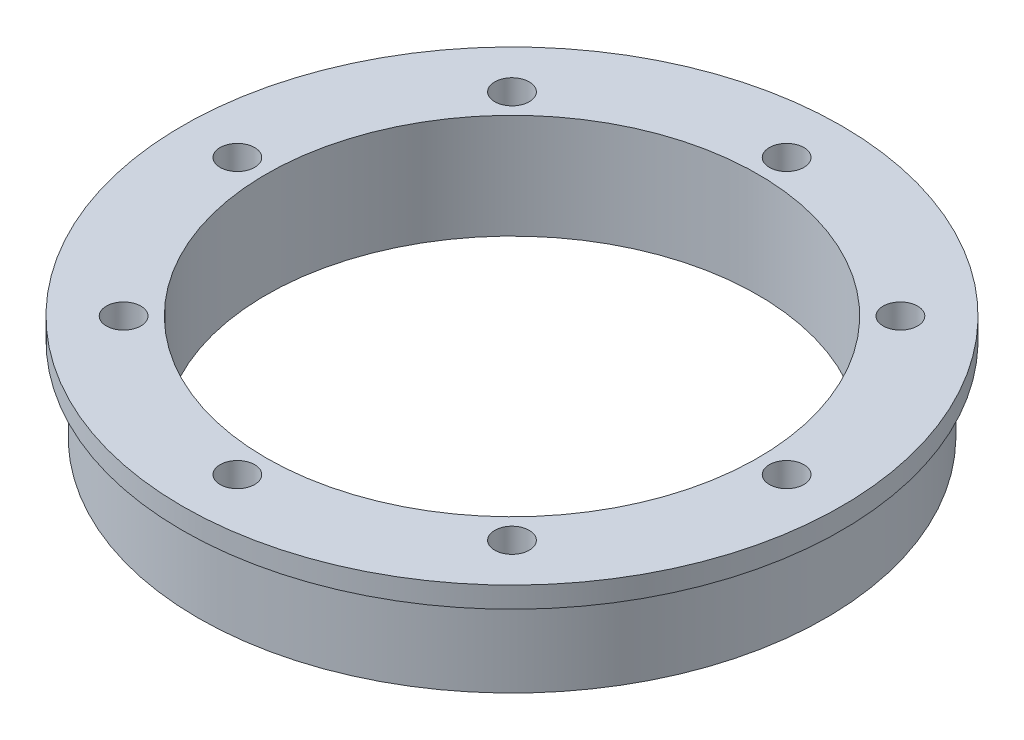
ISO-10303-21;
HEADER;
FILE_DESCRIPTION(('STEP AP214'),'2;1');
FILE_NAME('part.step','',(''),(''),'','','');
FILE_SCHEMA(('AUTOMOTIVE_DESIGN { 1 0 10303 214 1 1 1 1 }'));
ENDSEC;
DATA;
#1=APPLICATION_CONTEXT('core data for automotive mechanical design processes');
#2=APPLICATION_PROTOCOL_DEFINITION('international standard','automotive_design',2000,#1);
#3=PRODUCT_CONTEXT('',#1,'mechanical');
#4=PRODUCT('Part','Part','',(#3));
#5=PRODUCT_RELATED_PRODUCT_CATEGORY('part','',(#4));
#6=PRODUCT_DEFINITION_FORMATION('','',#4);
#7=PRODUCT_DEFINITION_CONTEXT('part definition',#1,'design');
#8=PRODUCT_DEFINITION('design','',#6,#7);
#9=PRODUCT_DEFINITION_SHAPE('','',#8);
#10=(LENGTH_UNIT() NAMED_UNIT(*) SI_UNIT(.MILLI.,.METRE.));
#11=(NAMED_UNIT(*) PLANE_ANGLE_UNIT() SI_UNIT($,.RADIAN.));
#12=(NAMED_UNIT(*) SI_UNIT($,.STERADIAN.) SOLID_ANGLE_UNIT());
#13=UNCERTAINTY_MEASURE_WITH_UNIT(LENGTH_MEASURE(1.E-05),#10,'distance_accuracy_value','');
#14=(GEOMETRIC_REPRESENTATION_CONTEXT(3) GLOBAL_UNCERTAINTY_ASSIGNED_CONTEXT((#13)) GLOBAL_UNIT_ASSIGNED_CONTEXT((#10,
#11,#12)) REPRESENTATION_CONTEXT('',''));
#15=CARTESIAN_POINT('',(0.,0.,0.));
#16=DIRECTION('',(0.,0.,1.));
#17=DIRECTION('',(1.,0.,0.));
#18=AXIS2_PLACEMENT_3D('',#15,#16,#17);
#19=CARTESIAN_POINT('',(0.,0.,0.));
#20=DIRECTION('',(0.,1.,0.));
#21=DIRECTION('',(0.,0.,1.));
#22=AXIS2_PLACEMENT_3D('',#19,#20,#21);
#23=PLANE('',#22);
#24=CARTESIAN_POINT('',(-18.5615530061469,0.,18.5615530061469));
#25=DIRECTION('',(0.,-1.,0.));
#26=DIRECTION('',(0.,0.,-1.));
#27=AXIS2_PLACEMENT_3D('',#24,#25,#26);
#28=CIRCLE('',#27,1.65);
#29=CARTESIAN_POINT('',(-18.5615530061469,0.,16.9115530061469));
#30=VERTEX_POINT('',#29);
#31=EDGE_CURVE('E107',#30,#30,#28,.T.);
#32=ORIENTED_EDGE('',*,*,#31,.F.);
#33=EDGE_LOOP('',(#32));
#34=FACE_BOUND('',#33,.T.);
#35=CARTESIAN_POINT('',(0.,0.,26.25));
#36=DIRECTION('',(0.,-1.,0.));
#37=DIRECTION('',(0.,0.,-1.));
#38=AXIS2_PLACEMENT_3D('',#35,#36,#37);
#39=CIRCLE('',#38,1.65);
#40=CARTESIAN_POINT('',(0.,0.,24.6));
#41=VERTEX_POINT('',#40);
#42=EDGE_CURVE('E101',#41,#41,#39,.T.);
#43=ORIENTED_EDGE('',*,*,#42,.F.);
#44=EDGE_LOOP('',(#43));
#45=FACE_BOUND('',#44,.T.);
#46=CARTESIAN_POINT('',(-18.5615530061469,0.,-18.5615530061469));
#47=DIRECTION('',(0.,-1.,0.));
#48=DIRECTION('',(0.,0.,-1.));
#49=AXIS2_PLACEMENT_3D('',#46,#47,#48);
#50=CIRCLE('',#49,1.65);
#51=CARTESIAN_POINT('',(-18.5615530061469,0.,-20.2115530061469));
#52=VERTEX_POINT('',#51);
#53=EDGE_CURVE('E89',#52,#52,#50,.T.);
#54=ORIENTED_EDGE('',*,*,#53,.F.);
#55=EDGE_LOOP('',(#54));
#56=FACE_BOUND('',#55,.T.);
#57=CARTESIAN_POINT('',(0.,0.,-26.25));
#58=DIRECTION('',(0.,-1.,0.));
#59=DIRECTION('',(0.,0.,-1.));
#60=AXIS2_PLACEMENT_3D('',#57,#58,#59);
#61=CIRCLE('',#60,1.65);
#62=CARTESIAN_POINT('',(0.,0.,-27.9));
#63=VERTEX_POINT('',#62);
#64=EDGE_CURVE('E83',#63,#63,#61,.T.);
#65=ORIENTED_EDGE('',*,*,#64,.F.);
#66=EDGE_LOOP('',(#65));
#67=FACE_BOUND('',#66,.T.);
#68=CARTESIAN_POINT('',(18.5615530061469,0.,-18.5615530061469));
#69=DIRECTION('',(0.,-1.,0.));
#70=DIRECTION('',(0.,0.,-1.));
#71=AXIS2_PLACEMENT_3D('',#68,#69,#70);
#72=CIRCLE('',#71,1.65);
#73=CARTESIAN_POINT('',(18.5615530061469,0.,-20.2115530061469));
#74=VERTEX_POINT('',#73);
#75=EDGE_CURVE('E77',#74,#74,#72,.T.);
#76=ORIENTED_EDGE('',*,*,#75,.F.);
#77=EDGE_LOOP('',(#76));
#78=FACE_BOUND('',#77,.T.);
#79=CARTESIAN_POINT('',(26.25,0.,0.));
#80=DIRECTION('',(0.,-1.,0.));
#81=DIRECTION('',(0.,0.,-1.));
#82=AXIS2_PLACEMENT_3D('',#79,#80,#81);
#83=CIRCLE('',#82,1.65);
#84=CARTESIAN_POINT('',(26.25,0.,-1.65));
#85=VERTEX_POINT('',#84);
#86=EDGE_CURVE('E71',#85,#85,#83,.T.);
#87=ORIENTED_EDGE('',*,*,#86,.F.);
#88=EDGE_LOOP('',(#87));
#89=FACE_BOUND('',#88,.T.);
#90=CARTESIAN_POINT('',(18.5615530061469,0.,18.5615530061469));
#91=DIRECTION('',(0.,-1.,0.));
#92=DIRECTION('',(0.,0.,-1.));
#93=AXIS2_PLACEMENT_3D('',#90,#91,#92);
#94=CIRCLE('',#93,1.65);
#95=CARTESIAN_POINT('',(18.5615530061469,0.,16.9115530061469));
#96=VERTEX_POINT('',#95);
#97=EDGE_CURVE('E65',#96,#96,#94,.T.);
#98=ORIENTED_EDGE('',*,*,#97,.F.);
#99=EDGE_LOOP('',(#98));
#100=FACE_BOUND('',#99,.T.);
#101=CARTESIAN_POINT('',(0.,0.,0.));
#102=DIRECTION('',(0.,1.,0.));
#103=DIRECTION('',(0.,0.,1.));
#104=AXIS2_PLACEMENT_3D('',#101,#102,#103);
#105=CIRCLE('',#104,30.);
#106=CARTESIAN_POINT('',(0.,0.,30.));
#107=VERTEX_POINT('',#106);
#108=EDGE_CURVE('E43',#107,#107,#105,.T.);
#109=ORIENTED_EDGE('',*,*,#108,.F.);
#110=EDGE_LOOP('',(#109));
#111=FACE_BOUND('',#110,.T.);
#112=CARTESIAN_POINT('',(0.,0.,0.));
#113=DIRECTION('',(0.,1.,0.));
#114=DIRECTION('',(0.,0.,1.));
#115=AXIS2_PLACEMENT_3D('',#112,#113,#114);
#116=CIRCLE('',#115,23.5);
#117=CARTESIAN_POINT('',(0.,0.,23.5));
#118=VERTEX_POINT('',#117);
#119=EDGE_CURVE('E51',#118,#118,#116,.T.);
#120=ORIENTED_EDGE('',*,*,#119,.T.);
#121=EDGE_LOOP('',(#120));
#122=FACE_BOUND('',#121,.T.);
#123=CARTESIAN_POINT('',(-26.25,0.,0.));
#124=DIRECTION('',(0.,-1.,0.));
#125=DIRECTION('',(0.,0.,-1.));
#126=AXIS2_PLACEMENT_3D('',#123,#124,#125);
#127=CIRCLE('',#126,1.65);
#128=CARTESIAN_POINT('',(-26.25,0.,-1.65));
#129=VERTEX_POINT('',#128);
#130=EDGE_CURVE('E95',#129,#129,#127,.T.);
#131=ORIENTED_EDGE('',*,*,#130,.F.);
#132=EDGE_LOOP('',(#131));
#133=FACE_BOUND('',#132,.T.);
#134=ADVANCED_FACE('F36',(#34,#45,#56,#67,#78,#89,#100,#111,#122,#133),#23,.F.);
#135=CARTESIAN_POINT('',(0.,10.,0.));
#136=DIRECTION('',(0.,-1.,0.));
#137=DIRECTION('',(0.,0.,-1.));
#138=AXIS2_PLACEMENT_3D('',#135,#136,#137);
#139=CYLINDRICAL_SURFACE('',#138,30.);
#140=ORIENTED_EDGE('',*,*,#108,.T.);
#141=EDGE_LOOP('',(#140));
#142=FACE_BOUND('',#141,.T.);
#143=CARTESIAN_POINT('',(0.,8.,0.));
#144=DIRECTION('',(0.,1.,0.));
#145=DIRECTION('',(0.,0.,1.));
#146=AXIS2_PLACEMENT_3D('',#143,#144,#145);
#147=CIRCLE('',#146,30.);
#148=CARTESIAN_POINT('',(0.,8.,30.));
#149=VERTEX_POINT('',#148);
#150=EDGE_CURVE('E10',#149,#149,#147,.T.);
#151=ORIENTED_EDGE('',*,*,#150,.F.);
#152=EDGE_LOOP('',(#151));
#153=FACE_BOUND('',#152,.T.);
#154=ADVANCED_FACE('F38',(#142,#153),#139,.T.);
#155=CARTESIAN_POINT('',(0.,10.,0.));
#156=DIRECTION('',(0.,1.,0.));
#157=DIRECTION('',(0.,0.,1.));
#158=AXIS2_PLACEMENT_3D('',#155,#156,#157);
#159=PLANE('',#158);
#160=CARTESIAN_POINT('',(-18.5615530061469,10.,18.5615530061469));
#161=DIRECTION('',(0.,-1.,0.));
#162=DIRECTION('',(0.,0.,-1.));
#163=AXIS2_PLACEMENT_3D('',#160,#161,#162);
#164=CIRCLE('',#163,1.65);
#165=CARTESIAN_POINT('',(-18.5615530061469,10.,16.9115530061469));
#166=VERTEX_POINT('',#165);
#167=EDGE_CURVE('E104',#166,#166,#164,.T.);
#168=ORIENTED_EDGE('',*,*,#167,.T.);
#169=EDGE_LOOP('',(#168));
#170=FACE_BOUND('',#169,.T.);
#171=CARTESIAN_POINT('',(0.,10.,26.25));
#172=DIRECTION('',(0.,-1.,0.));
#173=DIRECTION('',(0.,0.,-1.));
#174=AXIS2_PLACEMENT_3D('',#171,#172,#173);
#175=CIRCLE('',#174,1.65);
#176=CARTESIAN_POINT('',(0.,10.,24.6));
#177=VERTEX_POINT('',#176);
#178=EDGE_CURVE('E98',#177,#177,#175,.T.);
#179=ORIENTED_EDGE('',*,*,#178,.T.);
#180=EDGE_LOOP('',(#179));
#181=FACE_BOUND('',#180,.T.);
#182=CARTESIAN_POINT('',(-26.25,10.,0.));
#183=DIRECTION('',(0.,-1.,0.));
#184=DIRECTION('',(0.,0.,-1.));
#185=AXIS2_PLACEMENT_3D('',#182,#183,#184);
#186=CIRCLE('',#185,1.65);
#187=CARTESIAN_POINT('',(-26.25,10.,-1.65));
#188=VERTEX_POINT('',#187);
#189=EDGE_CURVE('E92',#188,#188,#186,.T.);
#190=ORIENTED_EDGE('',*,*,#189,.T.);
#191=EDGE_LOOP('',(#190));
#192=FACE_BOUND('',#191,.T.);
#193=CARTESIAN_POINT('',(-18.5615530061469,10.,-18.5615530061469));
#194=DIRECTION('',(0.,-1.,0.));
#195=DIRECTION('',(0.,0.,-1.));
#196=AXIS2_PLACEMENT_3D('',#193,#194,#195);
#197=CIRCLE('',#196,1.65);
#198=CARTESIAN_POINT('',(-18.5615530061469,10.,-20.2115530061469));
#199=VERTEX_POINT('',#198);
#200=EDGE_CURVE('E86',#199,#199,#197,.T.);
#201=ORIENTED_EDGE('',*,*,#200,.T.);
#202=EDGE_LOOP('',(#201));
#203=FACE_BOUND('',#202,.T.);
#204=CARTESIAN_POINT('',(0.,10.,-26.25));
#205=DIRECTION('',(0.,-1.,0.));
#206=DIRECTION('',(0.,0.,-1.));
#207=AXIS2_PLACEMENT_3D('',#204,#205,#206);
#208=CIRCLE('',#207,1.65);
#209=CARTESIAN_POINT('',(0.,10.,-27.9));
#210=VERTEX_POINT('',#209);
#211=EDGE_CURVE('E80',#210,#210,#208,.T.);
#212=ORIENTED_EDGE('',*,*,#211,.T.);
#213=EDGE_LOOP('',(#212));
#214=FACE_BOUND('',#213,.T.);
#215=CARTESIAN_POINT('',(18.5615530061469,10.,-18.5615530061469));
#216=DIRECTION('',(0.,-1.,0.));
#217=DIRECTION('',(0.,0.,-1.));
#218=AXIS2_PLACEMENT_3D('',#215,#216,#217);
#219=CIRCLE('',#218,1.65);
#220=CARTESIAN_POINT('',(18.5615530061469,10.,-20.2115530061469));
#221=VERTEX_POINT('',#220);
#222=EDGE_CURVE('E74',#221,#221,#219,.T.);
#223=ORIENTED_EDGE('',*,*,#222,.T.);
#224=EDGE_LOOP('',(#223));
#225=FACE_BOUND('',#224,.T.);
#226=CARTESIAN_POINT('',(26.25,10.,0.));
#227=DIRECTION('',(0.,-1.,0.));
#228=DIRECTION('',(0.,0.,-1.));
#229=AXIS2_PLACEMENT_3D('',#226,#227,#228);
#230=CIRCLE('',#229,1.65);
#231=CARTESIAN_POINT('',(26.25,10.,-1.65));
#232=VERTEX_POINT('',#231);
#233=EDGE_CURVE('E68',#232,#232,#230,.T.);
#234=ORIENTED_EDGE('',*,*,#233,.T.);
#235=EDGE_LOOP('',(#234));
#236=FACE_BOUND('',#235,.T.);
#237=CARTESIAN_POINT('',(18.5615530061469,10.,18.5615530061469));
#238=DIRECTION('',(0.,-1.,0.));
#239=DIRECTION('',(0.,0.,-1.));
#240=AXIS2_PLACEMENT_3D('',#237,#238,#239);
#241=CIRCLE('',#240,1.65);
#242=CARTESIAN_POINT('',(18.5615530061469,10.,16.9115530061469));
#243=VERTEX_POINT('',#242);
#244=EDGE_CURVE('E60',#243,#243,#241,.T.);
#245=ORIENTED_EDGE('',*,*,#244,.T.);
#246=EDGE_LOOP('',(#245));
#247=FACE_BOUND('',#246,.T.);
#248=CARTESIAN_POINT('',(0.,10.,0.));
#249=DIRECTION('',(0.,1.,0.));
#250=DIRECTION('',(0.,0.,1.));
#251=AXIS2_PLACEMENT_3D('',#248,#249,#250);
#252=CIRCLE('',#251,23.5);
#253=CARTESIAN_POINT('',(0.,10.,23.5));
#254=VERTEX_POINT('',#253);
#255=EDGE_CURVE('E47',#254,#254,#252,.T.);
#256=ORIENTED_EDGE('',*,*,#255,.F.);
#257=EDGE_LOOP('',(#256));
#258=FACE_BOUND('',#257,.T.);
#259=CARTESIAN_POINT('',(0.,10.,0.));
#260=DIRECTION('',(0.,1.,0.));
#261=DIRECTION('',(0.,0.,1.));
#262=AXIS2_PLACEMENT_3D('',#259,#260,#261);
#263=CIRCLE('',#262,31.5);
#264=CARTESIAN_POINT('',(0.,10.,31.5));
#265=VERTEX_POINT('',#264);
#266=EDGE_CURVE('E57',#265,#265,#263,.T.);
#267=ORIENTED_EDGE('',*,*,#266,.T.);
#268=EDGE_LOOP('',(#267));
#269=FACE_BOUND('',#268,.T.);
#270=ADVANCED_FACE('F175',(#170,#181,#192,#203,#214,#225,#236,#247,#258,#269),#159,.T.);
#271=CARTESIAN_POINT('',(0.,10.,0.));
#272=DIRECTION('',(0.,-1.,0.));
#273=DIRECTION('',(0.,0.,-1.));
#274=AXIS2_PLACEMENT_3D('',#271,#272,#273);
#275=CYLINDRICAL_SURFACE('',#274,23.5);
#276=ORIENTED_EDGE('',*,*,#255,.T.);
#277=EDGE_LOOP('',(#276));
#278=FACE_BOUND('',#277,.T.);
#279=ORIENTED_EDGE('',*,*,#119,.F.);
#280=EDGE_LOOP('',(#279));
#281=FACE_BOUND('',#280,.T.);
#282=ADVANCED_FACE('F171',(#278,#281),#275,.F.);
#283=CARTESIAN_POINT('',(0.,8.,0.));
#284=DIRECTION('',(0.,1.,0.));
#285=DIRECTION('',(0.,0.,1.));
#286=AXIS2_PLACEMENT_3D('',#283,#284,#285);
#287=CYLINDRICAL_SURFACE('',#286,31.5);
#288=CARTESIAN_POINT('',(0.,8.,0.));
#289=DIRECTION('',(0.,1.,0.));
#290=DIRECTION('',(0.,0.,1.));
#291=AXIS2_PLACEMENT_3D('',#288,#289,#290);
#292=CIRCLE('',#291,31.5);
#293=CARTESIAN_POINT('',(0.,8.,31.5));
#294=VERTEX_POINT('',#293);
#295=EDGE_CURVE('E55',#294,#294,#292,.T.);
#296=ORIENTED_EDGE('',*,*,#295,.T.);
#297=EDGE_LOOP('',(#296));
#298=FACE_BOUND('',#297,.T.);
#299=ORIENTED_EDGE('',*,*,#266,.F.);
#300=EDGE_LOOP('',(#299));
#301=FACE_BOUND('',#300,.T.);
#302=ADVANCED_FACE('F168',(#298,#301),#287,.T.);
#303=CARTESIAN_POINT('',(0.,8.,0.));
#304=DIRECTION('',(0.,1.,0.));
#305=DIRECTION('',(0.,0.,1.));
#306=AXIS2_PLACEMENT_3D('',#303,#304,#305);
#307=PLANE('',#306);
#308=ORIENTED_EDGE('',*,*,#150,.T.);
#309=EDGE_LOOP('',(#308));
#310=FACE_BOUND('',#309,.T.);
#311=ORIENTED_EDGE('',*,*,#295,.F.);
#312=EDGE_LOOP('',(#311));
#313=FACE_BOUND('',#312,.T.);
#314=ADVANCED_FACE('F164',(#310,#313),#307,.F.);
#315=CARTESIAN_POINT('',(18.5615530061469,0.,18.5615530061469));
#316=DIRECTION('',(0.,-1.,0.));
#317=DIRECTION('',(0.,0.,-1.));
#318=AXIS2_PLACEMENT_3D('',#315,#316,#317);
#319=CYLINDRICAL_SURFACE('',#318,1.65);
#320=ORIENTED_EDGE('',*,*,#244,.F.);
#321=EDGE_LOOP('',(#320));
#322=FACE_BOUND('',#321,.T.);
#323=ORIENTED_EDGE('',*,*,#97,.T.);
#324=EDGE_LOOP('',(#323));
#325=FACE_BOUND('',#324,.T.);
#326=ADVANCED_FACE('F160',(#322,#325),#319,.F.);
#327=CARTESIAN_POINT('',(26.25,0.,0.));
#328=DIRECTION('',(0.,-1.,0.));
#329=DIRECTION('',(0.,0.,-1.));
#330=AXIS2_PLACEMENT_3D('',#327,#328,#329);
#331=CYLINDRICAL_SURFACE('',#330,1.65);
#332=ORIENTED_EDGE('',*,*,#233,.F.);
#333=EDGE_LOOP('',(#332));
#334=FACE_BOUND('',#333,.T.);
#335=ORIENTED_EDGE('',*,*,#86,.T.);
#336=EDGE_LOOP('',(#335));
#337=FACE_BOUND('',#336,.T.);
#338=ADVANCED_FACE('F156',(#334,#337),#331,.F.);
#339=CARTESIAN_POINT('',(18.5615530061469,0.,-18.5615530061469));
#340=DIRECTION('',(0.,-1.,0.));
#341=DIRECTION('',(0.,0.,-1.));
#342=AXIS2_PLACEMENT_3D('',#339,#340,#341);
#343=CYLINDRICAL_SURFACE('',#342,1.65);
#344=ORIENTED_EDGE('',*,*,#222,.F.);
#345=EDGE_LOOP('',(#344));
#346=FACE_BOUND('',#345,.T.);
#347=ORIENTED_EDGE('',*,*,#75,.T.);
#348=EDGE_LOOP('',(#347));
#349=FACE_BOUND('',#348,.T.);
#350=ADVANCED_FACE('F152',(#346,#349),#343,.F.);
#351=CARTESIAN_POINT('',(0.,0.,-26.25));
#352=DIRECTION('',(0.,-1.,0.));
#353=DIRECTION('',(0.,0.,-1.));
#354=AXIS2_PLACEMENT_3D('',#351,#352,#353);
#355=CYLINDRICAL_SURFACE('',#354,1.65);
#356=ORIENTED_EDGE('',*,*,#211,.F.);
#357=EDGE_LOOP('',(#356));
#358=FACE_BOUND('',#357,.T.);
#359=ORIENTED_EDGE('',*,*,#64,.T.);
#360=EDGE_LOOP('',(#359));
#361=FACE_BOUND('',#360,.T.);
#362=ADVANCED_FACE('F144',(#358,#361),#355,.F.);
#363=CARTESIAN_POINT('',(-18.5615530061469,0.,-18.5615530061469));
#364=DIRECTION('',(0.,-1.,0.));
#365=DIRECTION('',(0.,0.,-1.));
#366=AXIS2_PLACEMENT_3D('',#363,#364,#365);
#367=CYLINDRICAL_SURFACE('',#366,1.65);
#368=ORIENTED_EDGE('',*,*,#200,.F.);
#369=EDGE_LOOP('',(#368));
#370=FACE_BOUND('',#369,.T.);
#371=ORIENTED_EDGE('',*,*,#53,.T.);
#372=EDGE_LOOP('',(#371));
#373=FACE_BOUND('',#372,.T.);
#374=ADVANCED_FACE('F135',(#370,#373),#367,.F.);
#375=CARTESIAN_POINT('',(-26.25,0.,0.));
#376=DIRECTION('',(0.,-1.,0.));
#377=DIRECTION('',(0.,0.,-1.));
#378=AXIS2_PLACEMENT_3D('',#375,#376,#377);
#379=CYLINDRICAL_SURFACE('',#378,1.65);
#380=ORIENTED_EDGE('',*,*,#189,.F.);
#381=EDGE_LOOP('',(#380));
#382=FACE_BOUND('',#381,.T.);
#383=ORIENTED_EDGE('',*,*,#130,.T.);
#384=EDGE_LOOP('',(#383));
#385=FACE_BOUND('',#384,.T.);
#386=ADVANCED_FACE('F132',(#382,#385),#379,.F.);
#387=CARTESIAN_POINT('',(0.,0.,26.25));
#388=DIRECTION('',(0.,-1.,0.));
#389=DIRECTION('',(0.,0.,-1.));
#390=AXIS2_PLACEMENT_3D('',#387,#388,#389);
#391=CYLINDRICAL_SURFACE('',#390,1.65);
#392=ORIENTED_EDGE('',*,*,#178,.F.);
#393=EDGE_LOOP('',(#392));
#394=FACE_BOUND('',#393,.T.);
#395=ORIENTED_EDGE('',*,*,#42,.T.);
#396=EDGE_LOOP('',(#395));
#397=FACE_BOUND('',#396,.T.);
#398=ADVANCED_FACE('F134',(#394,#397),#391,.F.);
#399=CARTESIAN_POINT('',(-18.5615530061469,0.,18.5615530061469));
#400=DIRECTION('',(0.,-1.,0.));
#401=DIRECTION('',(0.,0.,-1.));
#402=AXIS2_PLACEMENT_3D('',#399,#400,#401);
#403=CYLINDRICAL_SURFACE('',#402,1.65);
#404=ORIENTED_EDGE('',*,*,#167,.F.);
#405=EDGE_LOOP('',(#404));
#406=FACE_BOUND('',#405,.T.);
#407=ORIENTED_EDGE('',*,*,#31,.T.);
#408=EDGE_LOOP('',(#407));
#409=FACE_BOUND('',#408,.T.);
#410=ADVANCED_FACE('F111',(#406,#409),#403,.F.);
#411=CLOSED_SHELL('',(#134,#154,#270,#282,#302,#314,#326,#338,#350,#362,#374,#386,#398,#410));
#412=MANIFOLD_SOLID_BREP('B2',#411);
#413=ADVANCED_BREP_SHAPE_REPRESENTATION('',(#18,#412),#14);
#414=SHAPE_DEFINITION_REPRESENTATION(#9,#413);
ENDSEC;
END-ISO-10303-21;
